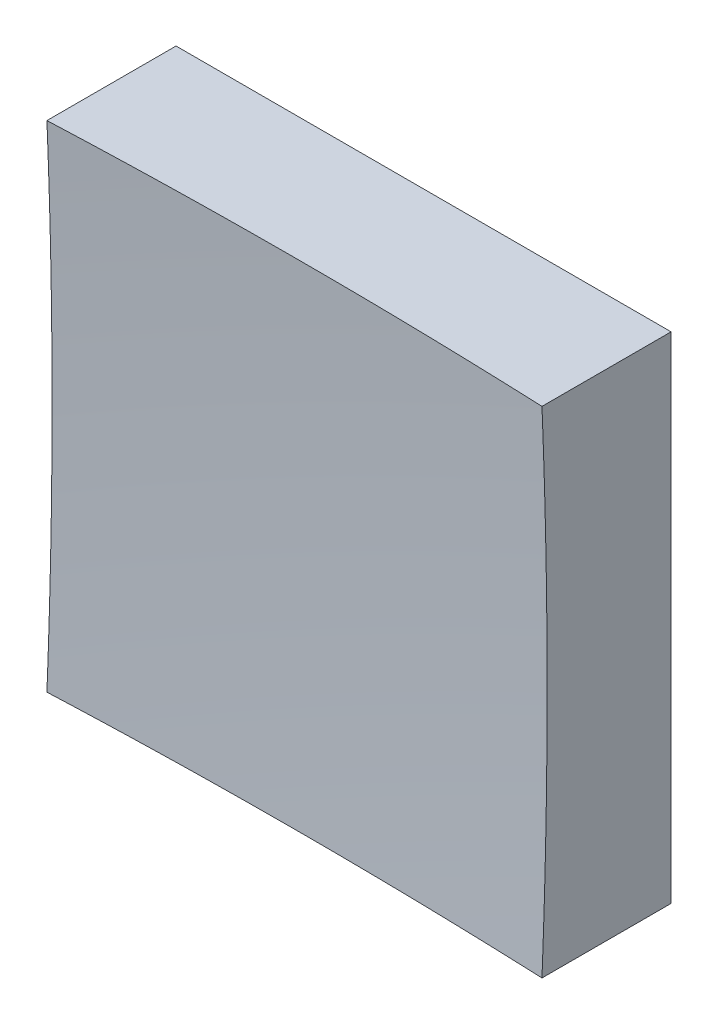
ISO-10303-21;
HEADER;
FILE_DESCRIPTION(('STEP AP214'),'2;1');
FILE_NAME('part.step','',(''),(''),'','','');
FILE_SCHEMA(('AUTOMOTIVE_DESIGN { 1 0 10303 214 1 1 1 1 }'));
ENDSEC;
DATA;
#1=APPLICATION_CONTEXT('core data for automotive mechanical design processes');
#2=APPLICATION_PROTOCOL_DEFINITION('international standard','automotive_design',2000,#1);
#3=PRODUCT_CONTEXT('',#1,'mechanical');
#4=PRODUCT('Part','Part','',(#3));
#5=PRODUCT_RELATED_PRODUCT_CATEGORY('part','',(#4));
#6=PRODUCT_DEFINITION_FORMATION('','',#4);
#7=PRODUCT_DEFINITION_CONTEXT('part definition',#1,'design');
#8=PRODUCT_DEFINITION('design','',#6,#7);
#9=PRODUCT_DEFINITION_SHAPE('','',#8);
#10=(LENGTH_UNIT() NAMED_UNIT(*) SI_UNIT(.MILLI.,.METRE.));
#11=(NAMED_UNIT(*) PLANE_ANGLE_UNIT() SI_UNIT($,.RADIAN.));
#12=(NAMED_UNIT(*) SI_UNIT($,.STERADIAN.) SOLID_ANGLE_UNIT());
#13=UNCERTAINTY_MEASURE_WITH_UNIT(LENGTH_MEASURE(1.E-05),#10,'distance_accuracy_value','');
#14=(GEOMETRIC_REPRESENTATION_CONTEXT(3) GLOBAL_UNCERTAINTY_ASSIGNED_CONTEXT((#13)) GLOBAL_UNIT_ASSIGNED_CONTEXT((#10,
#11,#12)) REPRESENTATION_CONTEXT('',''));
#15=CARTESIAN_POINT('',(0.,0.,0.));
#16=DIRECTION('',(0.,0.,1.));
#17=DIRECTION('',(1.,0.,0.));
#18=AXIS2_PLACEMENT_3D('',#15,#16,#17);
#19=CARTESIAN_POINT('',(-6.25,6.25,10.));
#20=DIRECTION('',(0.,1.,0.));
#21=DIRECTION('',(0.,0.,1.));
#22=AXIS2_PLACEMENT_3D('',#19,#20,#21);
#23=PLANE('',#22);
#24=CARTESIAN_POINT('',(0.,6.25,153.));
#25=DIRECTION('',(0.,1.,0.));
#26=DIRECTION('',(0.,0.,1.));
#27=AXIS2_PLACEMENT_3D('',#24,#25,#26);
#28=CIRCLE('',#27,149.869735103522);
#29=CARTESIAN_POINT('',(6.25,6.25,3.26064311611329));
#30=VERTEX_POINT('',#29);
#31=CARTESIAN_POINT('',(-6.25,6.25,3.26064311611329));
#32=VERTEX_POINT('',#31);
#33=EDGE_CURVE('E79',#30,#32,#28,.T.);
#34=ORIENTED_EDGE('',*,*,#33,.F.);
#35=DIRECTION('',(0.,0.,-1.));
#36=VECTOR('',#35,1.);
#37=CARTESIAN_POINT('',(6.25,6.25,10.));
#38=LINE('',#37,#36);
#39=CARTESIAN_POINT('',(6.25,6.25,0.));
#40=VERTEX_POINT('',#39);
#41=EDGE_CURVE('E85',#30,#40,#38,.T.);
#42=ORIENTED_EDGE('',*,*,#41,.T.);
#43=DIRECTION('',(1.,0.,0.));
#44=VECTOR('',#43,1.);
#45=CARTESIAN_POINT('',(-6.25,6.25,0.));
#46=LINE('',#45,#44);
#47=CARTESIAN_POINT('',(-6.25,6.25,0.));
#48=VERTEX_POINT('',#47);
#49=EDGE_CURVE('E88',#48,#40,#46,.T.);
#50=ORIENTED_EDGE('',*,*,#49,.F.);
#51=DIRECTION('',(0.,0.,-1.));
#52=VECTOR('',#51,1.);
#53=CARTESIAN_POINT('',(-6.25,6.25,10.));
#54=LINE('',#53,#52);
#55=EDGE_CURVE('E47',#32,#48,#54,.T.);
#56=ORIENTED_EDGE('',*,*,#55,.F.);
#57=EDGE_LOOP('',(#34,#42,#50,#56));
#58=FACE_BOUND('',#57,.T.);
#59=ADVANCED_FACE('F39',(#58),#23,.T.);
#60=CARTESIAN_POINT('',(-6.25,6.25,10.));
#61=DIRECTION('',(1.,0.,0.));
#62=DIRECTION('',(0.,0.,-1.));
#63=AXIS2_PLACEMENT_3D('',#60,#61,#62);
#64=PLANE('',#63);
#65=DIRECTION('',(0.,0.,-1.));
#66=VECTOR('',#65,1.);
#67=CARTESIAN_POINT('',(-6.25,-6.25,10.));
#68=LINE('',#67,#66);
#69=CARTESIAN_POINT('',(-6.25,-6.25,3.26064311611329));
#70=VERTEX_POINT('',#69);
#71=CARTESIAN_POINT('',(-6.25,-6.25,0.));
#72=VERTEX_POINT('',#71);
#73=EDGE_CURVE('E100',#70,#72,#68,.T.);
#74=ORIENTED_EDGE('',*,*,#73,.F.);
#75=CARTESIAN_POINT('',(-6.25,0.,153.));
#76=DIRECTION('',(1.,0.,0.));
#77=DIRECTION('',(0.,0.,-1.));
#78=AXIS2_PLACEMENT_3D('',#75,#76,#77);
#79=CIRCLE('',#78,149.869735103522);
#80=EDGE_CURVE('E89',#70,#32,#79,.T.);
#81=ORIENTED_EDGE('',*,*,#80,.T.);
#82=ORIENTED_EDGE('',*,*,#55,.T.);
#83=DIRECTION('',(0.,-1.,0.));
#84=VECTOR('',#83,1.);
#85=CARTESIAN_POINT('',(-6.25,6.25,0.));
#86=LINE('',#85,#84);
#87=EDGE_CURVE('E97',#48,#72,#86,.T.);
#88=ORIENTED_EDGE('',*,*,#87,.T.);
#89=EDGE_LOOP('',(#74,#81,#82,#88));
#90=FACE_BOUND('',#89,.T.);
#91=ADVANCED_FACE('F122',(#90),#64,.F.);
#92=CARTESIAN_POINT('',(-6.25,-6.25,10.));
#93=DIRECTION('',(0.,1.,0.));
#94=DIRECTION('',(0.,0.,1.));
#95=AXIS2_PLACEMENT_3D('',#92,#93,#94);
#96=PLANE('',#95);
#97=DIRECTION('',(0.,0.,-1.));
#98=VECTOR('',#97,1.);
#99=CARTESIAN_POINT('',(6.25,-6.25,10.));
#100=LINE('',#99,#98);
#101=CARTESIAN_POINT('',(6.25,-6.25,3.26064311611329));
#102=VERTEX_POINT('',#101);
#103=CARTESIAN_POINT('',(6.25,-6.25,0.));
#104=VERTEX_POINT('',#103);
#105=EDGE_CURVE('E96',#102,#104,#100,.T.);
#106=ORIENTED_EDGE('',*,*,#105,.F.);
#107=CARTESIAN_POINT('',(0.,-6.25,153.));
#108=DIRECTION('',(0.,1.,0.));
#109=DIRECTION('',(0.,0.,1.));
#110=AXIS2_PLACEMENT_3D('',#107,#108,#109);
#111=CIRCLE('',#110,149.869735103522);
#112=EDGE_CURVE('E53',#102,#70,#111,.T.);
#113=ORIENTED_EDGE('',*,*,#112,.T.);
#114=ORIENTED_EDGE('',*,*,#73,.T.);
#115=DIRECTION('',(1.,0.,0.));
#116=VECTOR('',#115,1.);
#117=CARTESIAN_POINT('',(-6.25,-6.25,0.));
#118=LINE('',#117,#116);
#119=EDGE_CURVE('E102',#72,#104,#118,.T.);
#120=ORIENTED_EDGE('',*,*,#119,.T.);
#121=EDGE_LOOP('',(#106,#113,#114,#120));
#122=FACE_BOUND('',#121,.T.);
#123=ADVANCED_FACE('F121',(#122),#96,.F.);
#124=CARTESIAN_POINT('',(6.25,6.25,10.));
#125=DIRECTION('',(1.,0.,0.));
#126=DIRECTION('',(0.,0.,-1.));
#127=AXIS2_PLACEMENT_3D('',#124,#125,#126);
#128=PLANE('',#127);
#129=CARTESIAN_POINT('',(6.25,0.,153.));
#130=DIRECTION('',(1.,0.,0.));
#131=DIRECTION('',(0.,0.,-1.));
#132=AXIS2_PLACEMENT_3D('',#129,#130,#131);
#133=CIRCLE('',#132,149.869735103522);
#134=EDGE_CURVE('E11',#102,#30,#133,.T.);
#135=ORIENTED_EDGE('',*,*,#134,.F.);
#136=ORIENTED_EDGE('',*,*,#105,.T.);
#137=DIRECTION('',(0.,-1.,0.));
#138=VECTOR('',#137,1.);
#139=CARTESIAN_POINT('',(6.25,6.25,0.));
#140=LINE('',#139,#138);
#141=EDGE_CURVE('E93',#40,#104,#140,.T.);
#142=ORIENTED_EDGE('',*,*,#141,.F.);
#143=ORIENTED_EDGE('',*,*,#41,.F.);
#144=EDGE_LOOP('',(#135,#136,#142,#143));
#145=FACE_BOUND('',#144,.T.);
#146=ADVANCED_FACE('F91',(#145),#128,.T.);
#147=CARTESIAN_POINT('',(0.,0.,0.));
#148=DIRECTION('',(0.,0.,-1.));
#149=DIRECTION('',(-1.,0.,0.));
#150=AXIS2_PLACEMENT_3D('',#147,#148,#149);
#151=PLANE('',#150);
#152=ORIENTED_EDGE('',*,*,#49,.T.);
#153=ORIENTED_EDGE('',*,*,#141,.T.);
#154=ORIENTED_EDGE('',*,*,#119,.F.);
#155=ORIENTED_EDGE('',*,*,#87,.F.);
#156=EDGE_LOOP('',(#152,#153,#154,#155));
#157=FACE_BOUND('',#156,.T.);
#158=ADVANCED_FACE('F125',(#157),#151,.T.);
#159=CARTESIAN_POINT('',(0.,0.,153.));
#160=DIRECTION('',(0.,0.,1.));
#161=DIRECTION('',(1.,0.,0.));
#162=AXIS2_PLACEMENT_3D('',#159,#160,#161);
#163=SPHERICAL_SURFACE('',#162,150.);
#164=ORIENTED_EDGE('',*,*,#33,.T.);
#165=ORIENTED_EDGE('',*,*,#80,.F.);
#166=ORIENTED_EDGE('',*,*,#112,.F.);
#167=ORIENTED_EDGE('',*,*,#134,.T.);
#168=EDGE_LOOP('',(#164,#165,#166,#167));
#169=FACE_BOUND('',#168,.T.);
#170=ADVANCED_FACE('F78',(#169),#163,.F.);
#171=CLOSED_SHELL('',(#59,#91,#123,#146,#158,#170));
#172=MANIFOLD_SOLID_BREP('B2',#171);
#173=ADVANCED_BREP_SHAPE_REPRESENTATION('',(#18,#172),#14);
#174=SHAPE_DEFINITION_REPRESENTATION(#9,#173);
ENDSEC;
END-ISO-10303-21;
